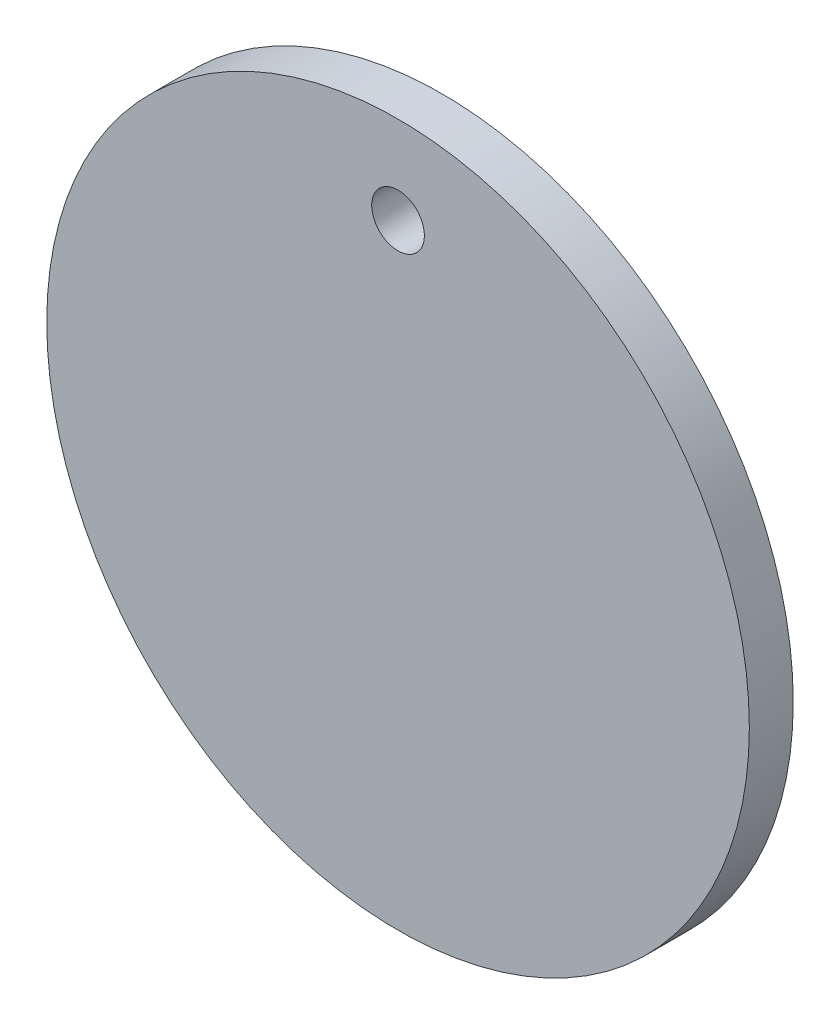
ISO-10303-21;
HEADER;
FILE_DESCRIPTION(('STEP AP214'),'2;1');
FILE_NAME('part.step','',(''),(''),'','','');
FILE_SCHEMA(('AUTOMOTIVE_DESIGN { 1 0 10303 214 1 1 1 1 }'));
ENDSEC;
DATA;
#1=APPLICATION_CONTEXT('core data for automotive mechanical design processes');
#2=APPLICATION_PROTOCOL_DEFINITION('international standard','automotive_design',2000,#1);
#3=PRODUCT_CONTEXT('',#1,'mechanical');
#4=PRODUCT('Part','Part','',(#3));
#5=PRODUCT_RELATED_PRODUCT_CATEGORY('part','',(#4));
#6=PRODUCT_DEFINITION_FORMATION('','',#4);
#7=PRODUCT_DEFINITION_CONTEXT('part definition',#1,'design');
#8=PRODUCT_DEFINITION('design','',#6,#7);
#9=PRODUCT_DEFINITION_SHAPE('','',#8);
#10=(LENGTH_UNIT() NAMED_UNIT(*) SI_UNIT(.MILLI.,.METRE.));
#11=(NAMED_UNIT(*) PLANE_ANGLE_UNIT() SI_UNIT($,.RADIAN.));
#12=(NAMED_UNIT(*) SI_UNIT($,.STERADIAN.) SOLID_ANGLE_UNIT());
#13=UNCERTAINTY_MEASURE_WITH_UNIT(LENGTH_MEASURE(1.E-05),#10,'distance_accuracy_value','');
#14=(GEOMETRIC_REPRESENTATION_CONTEXT(3) GLOBAL_UNCERTAINTY_ASSIGNED_CONTEXT((#13)) GLOBAL_UNIT_ASSIGNED_CONTEXT((#10,
#11,#12)) REPRESENTATION_CONTEXT('',''));
#15=CARTESIAN_POINT('',(0.,0.,0.));
#16=DIRECTION('',(0.,0.,1.));
#17=DIRECTION('',(1.,0.,0.));
#18=AXIS2_PLACEMENT_3D('',#15,#16,#17);
#19=CARTESIAN_POINT('',(0.,0.,3.175));
#20=DIRECTION('',(0.,0.,1.));
#21=DIRECTION('',(1.,0.,0.));
#22=AXIS2_PLACEMENT_3D('',#19,#20,#21);
#23=PLANE('',#22);
#24=CARTESIAN_POINT('',(0.,0.,3.175));
#25=DIRECTION('',(0.,0.,1.));
#26=DIRECTION('',(1.,0.,0.));
#27=AXIS2_PLACEMENT_3D('',#24,#25,#26);
#28=CIRCLE('',#27,25.4);
#29=CARTESIAN_POINT('',(25.4,0.,3.175));
#30=VERTEX_POINT('',#29);
#31=EDGE_CURVE('E10',#30,#30,#28,.T.);
#32=ORIENTED_EDGE('',*,*,#31,.T.);
#33=EDGE_LOOP('',(#32));
#34=FACE_BOUND('',#33,.T.);
#35=CARTESIAN_POINT('',(0.,19.05,3.175));
#36=DIRECTION('',(0.,0.,1.));
#37=DIRECTION('',(1.,0.,0.));
#38=AXIS2_PLACEMENT_3D('',#35,#36,#37);
#39=CIRCLE('',#38,1.905);
#40=CARTESIAN_POINT('',(1.905,19.05,3.175));
#41=VERTEX_POINT('',#40);
#42=EDGE_CURVE('E42',#41,#41,#39,.T.);
#43=ORIENTED_EDGE('',*,*,#42,.F.);
#44=EDGE_LOOP('',(#43));
#45=FACE_BOUND('',#44,.T.);
#46=ADVANCED_FACE('F31',(#34,#45),#23,.T.);
#47=CARTESIAN_POINT('',(0.,0.,0.));
#48=DIRECTION('',(0.,0.,1.));
#49=DIRECTION('',(1.,0.,0.));
#50=AXIS2_PLACEMENT_3D('',#47,#48,#49);
#51=PLANE('',#50);
#52=CARTESIAN_POINT('',(0.,0.,0.));
#53=DIRECTION('',(0.,0.,1.));
#54=DIRECTION('',(1.,0.,0.));
#55=AXIS2_PLACEMENT_3D('',#52,#53,#54);
#56=CIRCLE('',#55,25.4);
#57=CARTESIAN_POINT('',(25.4,0.,0.));
#58=VERTEX_POINT('',#57);
#59=EDGE_CURVE('E35',#58,#58,#56,.T.);
#60=ORIENTED_EDGE('',*,*,#59,.F.);
#61=EDGE_LOOP('',(#60));
#62=FACE_BOUND('',#61,.T.);
#63=CARTESIAN_POINT('',(0.,19.05,0.));
#64=DIRECTION('',(0.,0.,1.));
#65=DIRECTION('',(1.,0.,0.));
#66=AXIS2_PLACEMENT_3D('',#63,#64,#65);
#67=CIRCLE('',#66,1.905);
#68=CARTESIAN_POINT('',(1.905,19.05,0.));
#69=VERTEX_POINT('',#68);
#70=EDGE_CURVE('E44',#69,#69,#67,.T.);
#71=ORIENTED_EDGE('',*,*,#70,.T.);
#72=EDGE_LOOP('',(#71));
#73=FACE_BOUND('',#72,.T.);
#74=ADVANCED_FACE('F54',(#62,#73),#51,.F.);
#75=CARTESIAN_POINT('',(0.,0.,3.175));
#76=DIRECTION('',(0.,0.,-1.));
#77=DIRECTION('',(-1.,0.,0.));
#78=AXIS2_PLACEMENT_3D('',#75,#76,#77);
#79=CYLINDRICAL_SURFACE('',#78,25.4);
#80=ORIENTED_EDGE('',*,*,#31,.F.);
#81=EDGE_LOOP('',(#80));
#82=FACE_BOUND('',#81,.T.);
#83=ORIENTED_EDGE('',*,*,#59,.T.);
#84=EDGE_LOOP('',(#83));
#85=FACE_BOUND('',#84,.T.);
#86=ADVANCED_FACE('F33',(#82,#85),#79,.T.);
#87=CARTESIAN_POINT('',(0.,19.05,3.175));
#88=DIRECTION('',(0.,0.,-1.));
#89=DIRECTION('',(-1.,0.,0.));
#90=AXIS2_PLACEMENT_3D('',#87,#88,#89);
#91=CYLINDRICAL_SURFACE('',#90,1.905);
#92=ORIENTED_EDGE('',*,*,#42,.T.);
#93=EDGE_LOOP('',(#92));
#94=FACE_BOUND('',#93,.T.);
#95=ORIENTED_EDGE('',*,*,#70,.F.);
#96=EDGE_LOOP('',(#95));
#97=FACE_BOUND('',#96,.T.);
#98=ADVANCED_FACE('F50',(#94,#97),#91,.F.);
#99=CLOSED_SHELL('',(#46,#74,#86,#98));
#100=MANIFOLD_SOLID_BREP('B2',#99);
#101=ADVANCED_BREP_SHAPE_REPRESENTATION('',(#18,#100),#14);
#102=SHAPE_DEFINITION_REPRESENTATION(#9,#101);
ENDSEC;
END-ISO-10303-21;
